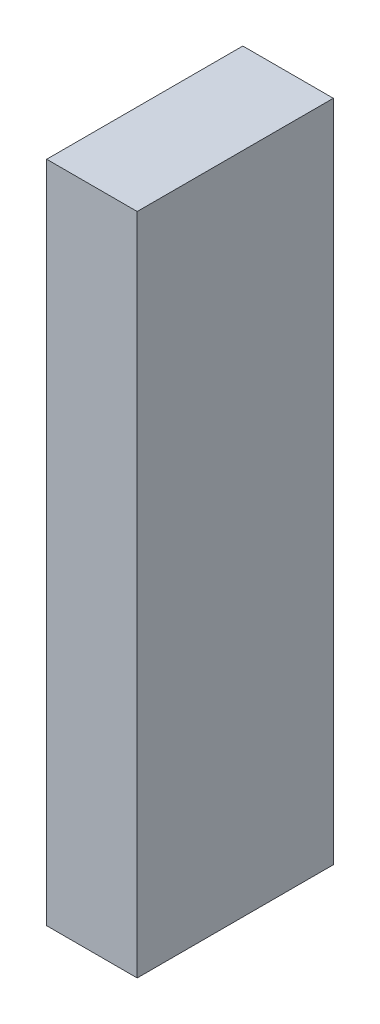
ISO-10303-21;
HEADER;
FILE_DESCRIPTION(('STEP AP214'),'2;1');
FILE_NAME('part.step','',(''),(''),'','','');
FILE_SCHEMA(('AUTOMOTIVE_DESIGN { 1 0 10303 214 1 1 1 1 }'));
ENDSEC;
DATA;
#1=APPLICATION_CONTEXT('core data for automotive mechanical design processes');
#2=APPLICATION_PROTOCOL_DEFINITION('international standard','automotive_design',2000,#1);
#3=PRODUCT_CONTEXT('',#1,'mechanical');
#4=PRODUCT('Part','Part','',(#3));
#5=PRODUCT_RELATED_PRODUCT_CATEGORY('part','',(#4));
#6=PRODUCT_DEFINITION_FORMATION('','',#4);
#7=PRODUCT_DEFINITION_CONTEXT('part definition',#1,'design');
#8=PRODUCT_DEFINITION('design','',#6,#7);
#9=PRODUCT_DEFINITION_SHAPE('','',#8);
#10=(LENGTH_UNIT() NAMED_UNIT(*) SI_UNIT(.MILLI.,.METRE.));
#11=(NAMED_UNIT(*) PLANE_ANGLE_UNIT() SI_UNIT($,.RADIAN.));
#12=(NAMED_UNIT(*) SI_UNIT($,.STERADIAN.) SOLID_ANGLE_UNIT());
#13=UNCERTAINTY_MEASURE_WITH_UNIT(LENGTH_MEASURE(1.E-05),#10,'distance_accuracy_value','');
#14=(GEOMETRIC_REPRESENTATION_CONTEXT(3) GLOBAL_UNCERTAINTY_ASSIGNED_CONTEXT((#13)) GLOBAL_UNIT_ASSIGNED_CONTEXT((#10,
#11,#12)) REPRESENTATION_CONTEXT('',''));
#15=CARTESIAN_POINT('',(0.,0.,0.));
#16=DIRECTION('',(0.,0.,1.));
#17=DIRECTION('',(1.,0.,0.));
#18=AXIS2_PLACEMENT_3D('',#15,#16,#17);
#19=CARTESIAN_POINT('',(2.3,-1.1,0.));
#20=DIRECTION('',(1.,0.,0.));
#21=DIRECTION('',(0.,0.,-1.));
#22=AXIS2_PLACEMENT_3D('',#19,#20,#21);
#23=PLANE('',#22);
#24=DIRECTION('',(0.,0.,1.));
#25=VECTOR('',#24,1.);
#26=CARTESIAN_POINT('',(2.3,-1.1,0.));
#27=LINE('',#26,#25);
#28=CARTESIAN_POINT('',(2.3,-1.1,0.65));
#29=VERTEX_POINT('',#28);
#30=CARTESIAN_POINT('',(2.3,-1.1,0.));
#31=VERTEX_POINT('',#30);
#32=EDGE_CURVE('E55',#29,#31,#27,.F.);
#33=ORIENTED_EDGE('',*,*,#32,.T.);
#34=DIRECTION('',(0.,1.,0.));
#35=VECTOR('',#34,1.);
#36=CARTESIAN_POINT('',(2.3,-1.1,0.));
#37=LINE('',#36,#35);
#38=CARTESIAN_POINT('',(2.3,1.1,0.));
#39=VERTEX_POINT('',#38);
#40=EDGE_CURVE('E75',#31,#39,#37,.T.);
#41=ORIENTED_EDGE('',*,*,#40,.T.);
#42=DIRECTION('',(0.,0.,-1.));
#43=VECTOR('',#42,1.);
#44=CARTESIAN_POINT('',(2.3,1.1,0.));
#45=LINE('',#44,#43);
#46=CARTESIAN_POINT('',(2.3,1.1,0.65));
#47=VERTEX_POINT('',#46);
#48=EDGE_CURVE('E20',#39,#47,#45,.F.);
#49=ORIENTED_EDGE('',*,*,#48,.T.);
#50=DIRECTION('',(0.,1.,0.));
#51=VECTOR('',#50,1.);
#52=CARTESIAN_POINT('',(2.3,-1.1,0.65));
#53=LINE('',#52,#51);
#54=EDGE_CURVE('E65',#29,#47,#53,.T.);
#55=ORIENTED_EDGE('',*,*,#54,.F.);
#56=EDGE_LOOP('',(#33,#41,#49,#55));
#57=FACE_BOUND('',#56,.T.);
#58=ADVANCED_FACE('F17',(#57),#23,.T.);
#59=CARTESIAN_POINT('',(2.,-1.1,0.65));
#60=DIRECTION('',(0.,0.,1.));
#61=DIRECTION('',(1.,0.,0.));
#62=AXIS2_PLACEMENT_3D('',#59,#60,#61);
#63=PLANE('',#62);
#64=DIRECTION('',(0.,1.,0.));
#65=VECTOR('',#64,1.);
#66=CARTESIAN_POINT('',(2.,-1.1,0.65));
#67=LINE('',#66,#65);
#68=CARTESIAN_POINT('',(2.,1.1,0.65));
#69=VERTEX_POINT('',#68);
#70=CARTESIAN_POINT('',(2.,-1.1,0.65));
#71=VERTEX_POINT('',#70);
#72=EDGE_CURVE('E73',#69,#71,#67,.F.);
#73=ORIENTED_EDGE('',*,*,#72,.T.);
#74=DIRECTION('',(1.,0.,0.));
#75=VECTOR('',#74,1.);
#76=CARTESIAN_POINT('',(2.,-1.1,0.65));
#77=LINE('',#76,#75);
#78=EDGE_CURVE('E62',#71,#29,#77,.T.);
#79=ORIENTED_EDGE('',*,*,#78,.T.);
#80=ORIENTED_EDGE('',*,*,#54,.T.);
#81=DIRECTION('',(1.,0.,0.));
#82=VECTOR('',#81,1.);
#83=CARTESIAN_POINT('',(2.,1.1,0.65));
#84=LINE('',#83,#82);
#85=EDGE_CURVE('E79',#69,#47,#84,.T.);
#86=ORIENTED_EDGE('',*,*,#85,.F.);
#87=EDGE_LOOP('',(#73,#79,#80,#86));
#88=FACE_BOUND('',#87,.T.);
#89=ADVANCED_FACE('F72',(#88),#63,.T.);
#90=CARTESIAN_POINT('',(2.,-1.1,0.));
#91=DIRECTION('',(0.,1.,0.));
#92=DIRECTION('',(0.,0.,1.));
#93=AXIS2_PLACEMENT_3D('',#90,#91,#92);
#94=PLANE('',#93);
#95=DIRECTION('',(0.,0.,-1.));
#96=VECTOR('',#95,1.);
#97=CARTESIAN_POINT('',(2.,-1.1,0.));
#98=LINE('',#97,#96);
#99=CARTESIAN_POINT('',(2.,-1.1,0.));
#100=VERTEX_POINT('',#99);
#101=EDGE_CURVE('E83',#71,#100,#98,.T.);
#102=ORIENTED_EDGE('',*,*,#101,.T.);
#103=DIRECTION('',(1.,0.,0.));
#104=VECTOR('',#103,1.);
#105=CARTESIAN_POINT('',(2.,-1.1,0.));
#106=LINE('',#105,#104);
#107=EDGE_CURVE('E64',#100,#31,#106,.T.);
#108=ORIENTED_EDGE('',*,*,#107,.T.);
#109=ORIENTED_EDGE('',*,*,#32,.F.);
#110=ORIENTED_EDGE('',*,*,#78,.F.);
#111=EDGE_LOOP('',(#102,#108,#109,#110));
#112=FACE_BOUND('',#111,.T.);
#113=ADVANCED_FACE('F60',(#112),#94,.F.);
#114=CARTESIAN_POINT('',(2.,-1.1,0.));
#115=DIRECTION('',(0.,0.,1.));
#116=DIRECTION('',(1.,0.,0.));
#117=AXIS2_PLACEMENT_3D('',#114,#115,#116);
#118=PLANE('',#117);
#119=ORIENTED_EDGE('',*,*,#107,.F.);
#120=DIRECTION('',(0.,1.,0.));
#121=VECTOR('',#120,1.);
#122=CARTESIAN_POINT('',(2.,-1.1,0.));
#123=LINE('',#122,#121);
#124=CARTESIAN_POINT('',(2.,1.1,0.));
#125=VERTEX_POINT('',#124);
#126=EDGE_CURVE('E26',#100,#125,#123,.T.);
#127=ORIENTED_EDGE('',*,*,#126,.T.);
#128=DIRECTION('',(1.,0.,0.));
#129=VECTOR('',#128,1.);
#130=CARTESIAN_POINT('',(2.,1.1,0.));
#131=LINE('',#130,#129);
#132=EDGE_CURVE('E34',#39,#125,#131,.F.);
#133=ORIENTED_EDGE('',*,*,#132,.F.);
#134=ORIENTED_EDGE('',*,*,#40,.F.);
#135=EDGE_LOOP('',(#119,#127,#133,#134));
#136=FACE_BOUND('',#135,.T.);
#137=ADVANCED_FACE('F88',(#136),#118,.F.);
#138=CARTESIAN_POINT('',(2.,1.1,0.));
#139=DIRECTION('',(0.,1.,0.));
#140=DIRECTION('',(0.,0.,1.));
#141=AXIS2_PLACEMENT_3D('',#138,#139,#140);
#142=PLANE('',#141);
#143=ORIENTED_EDGE('',*,*,#132,.T.);
#144=DIRECTION('',(0.,0.,-1.));
#145=VECTOR('',#144,1.);
#146=CARTESIAN_POINT('',(2.,1.1,0.));
#147=LINE('',#146,#145);
#148=EDGE_CURVE('E11',#125,#69,#147,.F.);
#149=ORIENTED_EDGE('',*,*,#148,.T.);
#150=ORIENTED_EDGE('',*,*,#85,.T.);
#151=ORIENTED_EDGE('',*,*,#48,.F.);
#152=EDGE_LOOP('',(#143,#149,#150,#151));
#153=FACE_BOUND('',#152,.T.);
#154=ADVANCED_FACE('F91',(#153),#142,.T.);
#155=CARTESIAN_POINT('',(2.,-1.1,0.));
#156=DIRECTION('',(1.,0.,0.));
#157=DIRECTION('',(0.,0.,-1.));
#158=AXIS2_PLACEMENT_3D('',#155,#156,#157);
#159=PLANE('',#158);
#160=ORIENTED_EDGE('',*,*,#126,.F.);
#161=ORIENTED_EDGE('',*,*,#101,.F.);
#162=ORIENTED_EDGE('',*,*,#72,.F.);
#163=ORIENTED_EDGE('',*,*,#148,.F.);
#164=EDGE_LOOP('',(#160,#161,#162,#163));
#165=FACE_BOUND('',#164,.T.);
#166=ADVANCED_FACE('F90',(#165),#159,.F.);
#167=CLOSED_SHELL('',(#58,#89,#113,#137,#154,#166));
#168=MANIFOLD_SOLID_BREP('B1',#167);
#169=ADVANCED_BREP_SHAPE_REPRESENTATION('',(#18,#168),#14);
#170=SHAPE_DEFINITION_REPRESENTATION(#9,#169);
ENDSEC;
END-ISO-10303-21;
